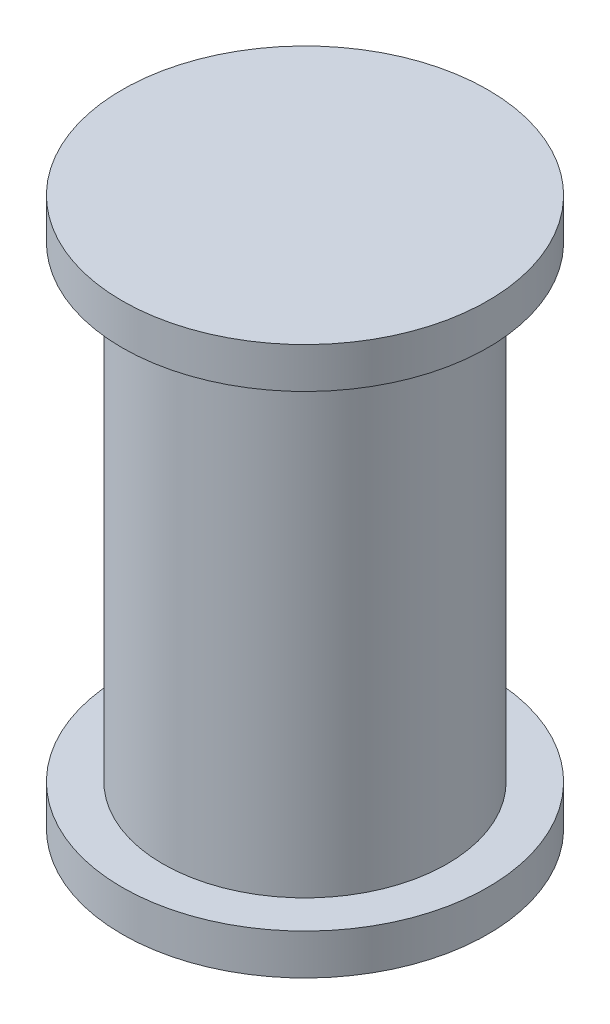
ISO-10303-21;
HEADER;
FILE_DESCRIPTION(('STEP AP214'),'2;1');
FILE_NAME('part.step','',(''),(''),'','','');
FILE_SCHEMA(('AUTOMOTIVE_DESIGN { 1 0 10303 214 1 1 1 1 }'));
ENDSEC;
DATA;
#1=APPLICATION_CONTEXT('core data for automotive mechanical design processes');
#2=APPLICATION_PROTOCOL_DEFINITION('international standard','automotive_design',2000,#1);
#3=PRODUCT_CONTEXT('',#1,'mechanical');
#4=PRODUCT('Part','Part','',(#3));
#5=PRODUCT_RELATED_PRODUCT_CATEGORY('part','',(#4));
#6=PRODUCT_DEFINITION_FORMATION('','',#4);
#7=PRODUCT_DEFINITION_CONTEXT('part definition',#1,'design');
#8=PRODUCT_DEFINITION('design','',#6,#7);
#9=PRODUCT_DEFINITION_SHAPE('','',#8);
#10=(LENGTH_UNIT() NAMED_UNIT(*) SI_UNIT(.MILLI.,.METRE.));
#11=(NAMED_UNIT(*) PLANE_ANGLE_UNIT() SI_UNIT($,.RADIAN.));
#12=(NAMED_UNIT(*) SI_UNIT($,.STERADIAN.) SOLID_ANGLE_UNIT());
#13=UNCERTAINTY_MEASURE_WITH_UNIT(LENGTH_MEASURE(1.E-05),#10,'distance_accuracy_value','');
#14=(GEOMETRIC_REPRESENTATION_CONTEXT(3) GLOBAL_UNCERTAINTY_ASSIGNED_CONTEXT((#13)) GLOBAL_UNIT_ASSIGNED_CONTEXT((#10,
#11,#12)) REPRESENTATION_CONTEXT('',''));
#15=CARTESIAN_POINT('',(0.,0.,0.));
#16=DIRECTION('',(0.,0.,1.));
#17=DIRECTION('',(1.,0.,0.));
#18=AXIS2_PLACEMENT_3D('',#15,#16,#17);
#19=CARTESIAN_POINT('',(0.,0.,0.));
#20=DIRECTION('',(0.,-1.,0.));
#21=DIRECTION('',(0.,0.,-1.));
#22=AXIS2_PLACEMENT_3D('',#19,#20,#21);
#23=PLANE('',#22);
#24=CARTESIAN_POINT('',(0.,0.,0.));
#25=DIRECTION('',(0.,1.,0.));
#26=DIRECTION('',(0.,0.,1.));
#27=AXIS2_PLACEMENT_3D('',#24,#25,#26);
#28=CIRCLE('',#27,1.4);
#29=CARTESIAN_POINT('',(0.,0.,1.4));
#30=VERTEX_POINT('',#29);
#31=EDGE_CURVE('E10',#30,#30,#28,.T.);
#32=ORIENTED_EDGE('',*,*,#31,.T.);
#33=EDGE_LOOP('',(#32));
#34=FACE_BOUND('',#33,.T.);
#35=CARTESIAN_POINT('',(0.,0.,0.));
#36=DIRECTION('',(0.,1.,0.));
#37=DIRECTION('',(0.,0.,1.));
#38=AXIS2_PLACEMENT_3D('',#35,#36,#37);
#39=CIRCLE('',#38,1.8);
#40=CARTESIAN_POINT('',(0.,0.,1.8));
#41=VERTEX_POINT('',#40);
#42=EDGE_CURVE('E59',#41,#41,#39,.T.);
#43=ORIENTED_EDGE('',*,*,#42,.F.);
#44=EDGE_LOOP('',(#43));
#45=FACE_BOUND('',#44,.T.);
#46=ADVANCED_FACE('F37',(#34,#45),#23,.T.);
#47=CARTESIAN_POINT('',(0.,0.399999999999994,0.));
#48=DIRECTION('',(0.,1.,0.));
#49=DIRECTION('',(0.,0.,1.));
#50=AXIS2_PLACEMENT_3D('',#47,#48,#49);
#51=CYLINDRICAL_SURFACE('',#50,1.4);
#52=CARTESIAN_POINT('',(0.,-4.6,0.));
#53=DIRECTION('',(0.,1.,0.));
#54=DIRECTION('',(0.,0.,1.));
#55=AXIS2_PLACEMENT_3D('',#52,#53,#54);
#56=CIRCLE('',#55,1.4);
#57=CARTESIAN_POINT('',(0.,-4.6,1.4));
#58=VERTEX_POINT('',#57);
#59=EDGE_CURVE('E43',#58,#58,#56,.T.);
#60=ORIENTED_EDGE('',*,*,#59,.T.);
#61=EDGE_LOOP('',(#60));
#62=FACE_BOUND('',#61,.T.);
#63=ORIENTED_EDGE('',*,*,#31,.F.);
#64=EDGE_LOOP('',(#63));
#65=FACE_BOUND('',#64,.T.);
#66=ADVANCED_FACE('F67',(#62,#65),#51,.T.);
#67=CARTESIAN_POINT('',(0.,-4.6,0.));
#68=DIRECTION('',(0.,-1.,0.));
#69=DIRECTION('',(0.,0.,-1.));
#70=AXIS2_PLACEMENT_3D('',#67,#68,#69);
#71=PLANE('',#70);
#72=ORIENTED_EDGE('',*,*,#59,.F.);
#73=EDGE_LOOP('',(#72));
#74=FACE_BOUND('',#73,.T.);
#75=CARTESIAN_POINT('',(0.,-4.6,0.));
#76=DIRECTION('',(0.,1.,0.));
#77=DIRECTION('',(0.,0.,1.));
#78=AXIS2_PLACEMENT_3D('',#75,#76,#77);
#79=CIRCLE('',#78,1.8);
#80=CARTESIAN_POINT('',(0.,-4.6,1.8));
#81=VERTEX_POINT('',#80);
#82=EDGE_CURVE('E47',#81,#81,#79,.T.);
#83=ORIENTED_EDGE('',*,*,#82,.T.);
#84=EDGE_LOOP('',(#83));
#85=FACE_BOUND('',#84,.T.);
#86=ADVANCED_FACE('F71',(#74,#85),#71,.F.);
#87=CARTESIAN_POINT('',(0.,0.399999999999994,0.));
#88=DIRECTION('',(0.,1.,0.));
#89=DIRECTION('',(0.,0.,1.));
#90=AXIS2_PLACEMENT_3D('',#87,#88,#89);
#91=CYLINDRICAL_SURFACE('',#90,1.8);
#92=ORIENTED_EDGE('',*,*,#82,.F.);
#93=EDGE_LOOP('',(#92));
#94=FACE_BOUND('',#93,.T.);
#95=CARTESIAN_POINT('',(0.,-5.,0.));
#96=DIRECTION('',(0.,1.,0.));
#97=DIRECTION('',(0.,0.,1.));
#98=AXIS2_PLACEMENT_3D('',#95,#96,#97);
#99=CIRCLE('',#98,1.8);
#100=CARTESIAN_POINT('',(0.,-5.,1.8));
#101=VERTEX_POINT('',#100);
#102=EDGE_CURVE('E51',#101,#101,#99,.T.);
#103=ORIENTED_EDGE('',*,*,#102,.T.);
#104=EDGE_LOOP('',(#103));
#105=FACE_BOUND('',#104,.T.);
#106=ADVANCED_FACE('F75',(#94,#105),#91,.T.);
#107=CARTESIAN_POINT('',(0.,-5.,0.));
#108=DIRECTION('',(0.,1.,0.));
#109=DIRECTION('',(0.,0.,1.));
#110=AXIS2_PLACEMENT_3D('',#107,#108,#109);
#111=PLANE('',#110);
#112=ORIENTED_EDGE('',*,*,#102,.F.);
#113=EDGE_LOOP('',(#112));
#114=FACE_BOUND('',#113,.T.);
#115=ADVANCED_FACE('F82',(#114),#111,.F.);
#116=CARTESIAN_POINT('',(0.,0.399999999999996,0.));
#117=DIRECTION('',(0.,1.,0.));
#118=DIRECTION('',(0.,0.,1.));
#119=AXIS2_PLACEMENT_3D('',#116,#117,#118);
#120=PLANE('',#119);
#121=CARTESIAN_POINT('',(0.,0.399999999999998,0.));
#122=DIRECTION('',(0.,1.,0.));
#123=DIRECTION('',(0.,0.,1.));
#124=AXIS2_PLACEMENT_3D('',#121,#122,#123);
#125=CIRCLE('',#124,1.8);
#126=CARTESIAN_POINT('',(0.,0.399999999999999,1.8));
#127=VERTEX_POINT('',#126);
#128=EDGE_CURVE('E56',#127,#127,#125,.T.);
#129=ORIENTED_EDGE('',*,*,#128,.T.);
#130=EDGE_LOOP('',(#129));
#131=FACE_BOUND('',#130,.T.);
#132=ADVANCED_FACE('F86',(#131),#120,.T.);
#133=CARTESIAN_POINT('',(0.,0.399999999999994,0.));
#134=DIRECTION('',(0.,1.,0.));
#135=DIRECTION('',(0.,0.,1.));
#136=AXIS2_PLACEMENT_3D('',#133,#134,#135);
#137=CYLINDRICAL_SURFACE('',#136,1.8);
#138=ORIENTED_EDGE('',*,*,#42,.T.);
#139=EDGE_LOOP('',(#138));
#140=FACE_BOUND('',#139,.T.);
#141=ORIENTED_EDGE('',*,*,#128,.F.);
#142=EDGE_LOOP('',(#141));
#143=FACE_BOUND('',#142,.T.);
#144=ADVANCED_FACE('F63',(#140,#143),#137,.T.);
#145=CLOSED_SHELL('',(#46,#66,#86,#106,#115,#132,#144));
#146=MANIFOLD_SOLID_BREP('B2',#145);
#147=ADVANCED_BREP_SHAPE_REPRESENTATION('',(#18,#146),#14);
#148=SHAPE_DEFINITION_REPRESENTATION(#9,#147);
ENDSEC;
END-ISO-10303-21;
